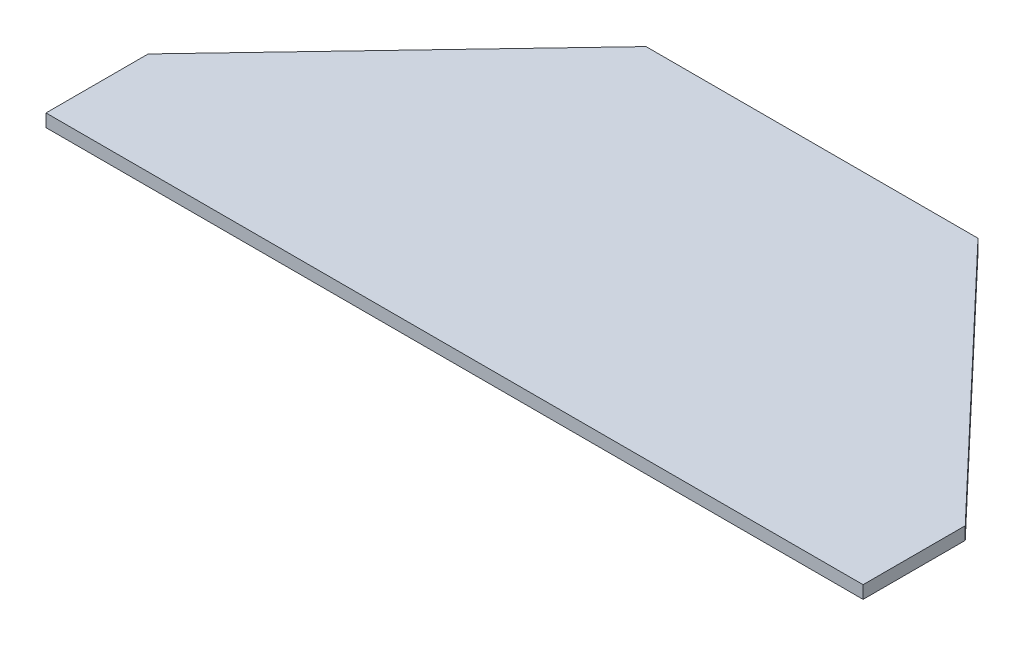
ISO-10303-21;
HEADER;
FILE_DESCRIPTION(('STEP AP214'),'2;1');
FILE_NAME('part.step','',(''),(''),'','','');
FILE_SCHEMA(('AUTOMOTIVE_DESIGN { 1 0 10303 214 1 1 1 1 }'));
ENDSEC;
DATA;
#1=APPLICATION_CONTEXT('core data for automotive mechanical design processes');
#2=APPLICATION_PROTOCOL_DEFINITION('international standard','automotive_design',2000,#1);
#3=PRODUCT_CONTEXT('',#1,'mechanical');
#4=PRODUCT('Part','Part','',(#3));
#5=PRODUCT_RELATED_PRODUCT_CATEGORY('part','',(#4));
#6=PRODUCT_DEFINITION_FORMATION('','',#4);
#7=PRODUCT_DEFINITION_CONTEXT('part definition',#1,'design');
#8=PRODUCT_DEFINITION('design','',#6,#7);
#9=PRODUCT_DEFINITION_SHAPE('','',#8);
#10=(LENGTH_UNIT() NAMED_UNIT(*) SI_UNIT(.MILLI.,.METRE.));
#11=(NAMED_UNIT(*) PLANE_ANGLE_UNIT() SI_UNIT($,.RADIAN.));
#12=(NAMED_UNIT(*) SI_UNIT($,.STERADIAN.) SOLID_ANGLE_UNIT());
#13=UNCERTAINTY_MEASURE_WITH_UNIT(LENGTH_MEASURE(1.E-05),#10,'distance_accuracy_value','');
#14=(GEOMETRIC_REPRESENTATION_CONTEXT(3) GLOBAL_UNCERTAINTY_ASSIGNED_CONTEXT((#13)) GLOBAL_UNIT_ASSIGNED_CONTEXT((#10,
#11,#12)) REPRESENTATION_CONTEXT('',''));
#15=CARTESIAN_POINT('',(0.,0.,0.));
#16=DIRECTION('',(0.,0.,1.));
#17=DIRECTION('',(1.,0.,0.));
#18=AXIS2_PLACEMENT_3D('',#15,#16,#17);
#19=CARTESIAN_POINT('',(-203.2,3.175,-50.8));
#20=DIRECTION('',(1.,0.,0.));
#21=DIRECTION('',(0.,0.,-1.));
#22=AXIS2_PLACEMENT_3D('',#19,#20,#21);
#23=PLANE('',#22);
#24=DIRECTION('',(0.,0.,1.));
#25=VECTOR('',#24,1.);
#26=CARTESIAN_POINT('',(-203.2,-3.175,-50.8));
#27=LINE('',#26,#25);
#28=CARTESIAN_POINT('',(-203.2,-3.175,-50.8));
#29=VERTEX_POINT('',#28);
#30=CARTESIAN_POINT('',(-203.2,-3.175,0.));
#31=VERTEX_POINT('',#30);
#32=EDGE_CURVE('E127',#29,#31,#27,.T.);
#33=ORIENTED_EDGE('',*,*,#32,.T.);
#34=DIRECTION('',(0.,-1.,0.));
#35=VECTOR('',#34,1.);
#36=CARTESIAN_POINT('',(-203.2,3.175,0.));
#37=LINE('',#36,#35);
#38=CARTESIAN_POINT('',(-203.2,3.175,0.));
#39=VERTEX_POINT('',#38);
#40=EDGE_CURVE('E11',#39,#31,#37,.T.);
#41=ORIENTED_EDGE('',*,*,#40,.F.);
#42=DIRECTION('',(0.,0.,1.));
#43=VECTOR('',#42,1.);
#44=CARTESIAN_POINT('',(-203.2,3.175,-50.8));
#45=LINE('',#44,#43);
#46=CARTESIAN_POINT('',(-203.2,3.175,-50.8));
#47=VERTEX_POINT('',#46);
#48=EDGE_CURVE('E137',#47,#39,#45,.T.);
#49=ORIENTED_EDGE('',*,*,#48,.F.);
#50=DIRECTION('',(0.,-1.,0.));
#51=VECTOR('',#50,1.);
#52=CARTESIAN_POINT('',(-203.2,3.175,-50.8));
#53=LINE('',#52,#51);
#54=EDGE_CURVE('E123',#47,#29,#53,.T.);
#55=ORIENTED_EDGE('',*,*,#54,.T.);
#56=EDGE_LOOP('',(#33,#41,#49,#55));
#57=FACE_BOUND('',#56,.T.);
#58=ADVANCED_FACE('F43',(#57),#23,.F.);
#59=CARTESIAN_POINT('',(-203.2,3.175,0.));
#60=DIRECTION('',(0.,0.,-1.));
#61=DIRECTION('',(-1.,0.,0.));
#62=AXIS2_PLACEMENT_3D('',#59,#60,#61);
#63=PLANE('',#62);
#64=DIRECTION('',(1.,0.,0.));
#65=VECTOR('',#64,1.);
#66=CARTESIAN_POINT('',(-203.2,-3.175,0.));
#67=LINE('',#66,#65);
#68=CARTESIAN_POINT('',(203.2,-3.175,0.));
#69=VERTEX_POINT('',#68);
#70=EDGE_CURVE('E130',#31,#69,#67,.T.);
#71=ORIENTED_EDGE('',*,*,#70,.T.);
#72=DIRECTION('',(0.,-1.,0.));
#73=VECTOR('',#72,1.);
#74=CARTESIAN_POINT('',(203.2,3.175,0.));
#75=LINE('',#74,#73);
#76=CARTESIAN_POINT('',(203.2,3.175,0.));
#77=VERTEX_POINT('',#76);
#78=EDGE_CURVE('E51',#77,#69,#75,.T.);
#79=ORIENTED_EDGE('',*,*,#78,.F.);
#80=DIRECTION('',(1.,0.,0.));
#81=VECTOR('',#80,1.);
#82=CARTESIAN_POINT('',(-203.2,3.175,0.));
#83=LINE('',#82,#81);
#84=EDGE_CURVE('E96',#39,#77,#83,.T.);
#85=ORIENTED_EDGE('',*,*,#84,.F.);
#86=ORIENTED_EDGE('',*,*,#40,.T.);
#87=EDGE_LOOP('',(#71,#79,#85,#86));
#88=FACE_BOUND('',#87,.T.);
#89=ADVANCED_FACE('F161',(#88),#63,.F.);
#90=CARTESIAN_POINT('',(203.2,3.175,0.));
#91=DIRECTION('',(-1.,0.,0.));
#92=DIRECTION('',(0.,0.,1.));
#93=AXIS2_PLACEMENT_3D('',#90,#91,#92);
#94=PLANE('',#93);
#95=DIRECTION('',(0.,0.,-1.));
#96=VECTOR('',#95,1.);
#97=CARTESIAN_POINT('',(203.2,-3.175,0.));
#98=LINE('',#97,#96);
#99=CARTESIAN_POINT('',(203.2,-3.175,-50.8000000000001));
#100=VERTEX_POINT('',#99);
#101=EDGE_CURVE('E132',#69,#100,#98,.T.);
#102=ORIENTED_EDGE('',*,*,#101,.T.);
#103=DIRECTION('',(0.,-1.,0.));
#104=VECTOR('',#103,1.);
#105=CARTESIAN_POINT('',(203.2,3.175,-50.8000000000001));
#106=LINE('',#105,#104);
#107=CARTESIAN_POINT('',(203.2,3.175,-50.8000000000001));
#108=VERTEX_POINT('',#107);
#109=EDGE_CURVE('E118',#108,#100,#106,.T.);
#110=ORIENTED_EDGE('',*,*,#109,.F.);
#111=DIRECTION('',(0.,0.,-1.));
#112=VECTOR('',#111,1.);
#113=CARTESIAN_POINT('',(203.2,3.175,0.));
#114=LINE('',#113,#112);
#115=EDGE_CURVE('E109',#77,#108,#114,.T.);
#116=ORIENTED_EDGE('',*,*,#115,.F.);
#117=ORIENTED_EDGE('',*,*,#78,.T.);
#118=EDGE_LOOP('',(#102,#110,#116,#117));
#119=FACE_BOUND('',#118,.T.);
#120=ADVANCED_FACE('F143',(#119),#94,.F.);
#121=CARTESIAN_POINT('',(203.2,3.175,-50.8000000000001));
#122=DIRECTION('',(-0.724999433594413,0.,0.688749461914693));
#123=DIRECTION('',(0.688749461914693,0.,0.724999433594413));
#124=AXIS2_PLACEMENT_3D('',#121,#122,#123);
#125=PLANE('',#124);
#126=DIRECTION('',(-0.688749461914693,0.,-0.724999433594413));
#127=VECTOR('',#126,1.);
#128=CARTESIAN_POINT('',(203.2,-3.175,-50.8000000000001));
#129=LINE('',#128,#127);
#130=CARTESIAN_POINT('',(82.55,-3.175,-177.8));
#131=VERTEX_POINT('',#130);
#132=EDGE_CURVE('E117',#100,#131,#129,.T.);
#133=ORIENTED_EDGE('',*,*,#132,.T.);
#134=DIRECTION('',(0.,-1.,0.));
#135=VECTOR('',#134,1.);
#136=CARTESIAN_POINT('',(82.55,3.175,-177.8));
#137=LINE('',#136,#135);
#138=CARTESIAN_POINT('',(82.55,3.175,-177.8));
#139=VERTEX_POINT('',#138);
#140=EDGE_CURVE('E114',#139,#131,#137,.T.);
#141=ORIENTED_EDGE('',*,*,#140,.F.);
#142=DIRECTION('',(-0.688749461914693,0.,-0.724999433594413));
#143=VECTOR('',#142,1.);
#144=CARTESIAN_POINT('',(203.2,3.175,-50.8000000000001));
#145=LINE('',#144,#143);
#146=EDGE_CURVE('E103',#108,#139,#145,.T.);
#147=ORIENTED_EDGE('',*,*,#146,.F.);
#148=ORIENTED_EDGE('',*,*,#109,.T.);
#149=EDGE_LOOP('',(#133,#141,#147,#148));
#150=FACE_BOUND('',#149,.T.);
#151=ADVANCED_FACE('F115',(#150),#125,.F.);
#152=CARTESIAN_POINT('',(82.55,3.175,-177.8));
#153=DIRECTION('',(0.,0.,1.));
#154=DIRECTION('',(1.,0.,0.));
#155=AXIS2_PLACEMENT_3D('',#152,#153,#154);
#156=PLANE('',#155);
#157=DIRECTION('',(-1.,0.,0.));
#158=VECTOR('',#157,1.);
#159=CARTESIAN_POINT('',(82.55,-3.175,-177.8));
#160=LINE('',#159,#158);
#161=CARTESIAN_POINT('',(-82.55,-3.175,-177.8));
#162=VERTEX_POINT('',#161);
#163=EDGE_CURVE('E82',#131,#162,#160,.T.);
#164=ORIENTED_EDGE('',*,*,#163,.T.);
#165=DIRECTION('',(0.,-1.,0.));
#166=VECTOR('',#165,1.);
#167=CARTESIAN_POINT('',(-82.55,3.175,-177.8));
#168=LINE('',#167,#166);
#169=CARTESIAN_POINT('',(-82.55,3.175,-177.8));
#170=VERTEX_POINT('',#169);
#171=EDGE_CURVE('E119',#170,#162,#168,.T.);
#172=ORIENTED_EDGE('',*,*,#171,.F.);
#173=DIRECTION('',(-1.,0.,0.));
#174=VECTOR('',#173,1.);
#175=CARTESIAN_POINT('',(82.55,3.175,-177.8));
#176=LINE('',#175,#174);
#177=EDGE_CURVE('E107',#139,#170,#176,.T.);
#178=ORIENTED_EDGE('',*,*,#177,.F.);
#179=ORIENTED_EDGE('',*,*,#140,.T.);
#180=EDGE_LOOP('',(#164,#172,#178,#179));
#181=FACE_BOUND('',#180,.T.);
#182=ADVANCED_FACE('F121',(#181),#156,.F.);
#183=CARTESIAN_POINT('',(-82.55,3.175,-177.8));
#184=DIRECTION('',(0.724999433594413,0.,0.688749461914693));
#185=DIRECTION('',(0.688749461914693,0.,-0.724999433594413));
#186=AXIS2_PLACEMENT_3D('',#183,#184,#185);
#187=PLANE('',#186);
#188=DIRECTION('',(-0.688749461914693,0.,0.724999433594414));
#189=VECTOR('',#188,1.);
#190=CARTESIAN_POINT('',(-82.55,-3.175,-177.8));
#191=LINE('',#190,#189);
#192=EDGE_CURVE('E88',#162,#29,#191,.T.);
#193=ORIENTED_EDGE('',*,*,#192,.T.);
#194=ORIENTED_EDGE('',*,*,#54,.F.);
#195=DIRECTION('',(-0.688749461914693,0.,0.724999433594414));
#196=VECTOR('',#195,1.);
#197=CARTESIAN_POINT('',(-82.55,3.175,-177.8));
#198=LINE('',#197,#196);
#199=EDGE_CURVE('E59',#170,#47,#198,.T.);
#200=ORIENTED_EDGE('',*,*,#199,.F.);
#201=ORIENTED_EDGE('',*,*,#171,.T.);
#202=EDGE_LOOP('',(#193,#194,#200,#201));
#203=FACE_BOUND('',#202,.T.);
#204=ADVANCED_FACE('F150',(#203),#187,.F.);
#205=CARTESIAN_POINT('',(0.,3.175,0.));
#206=DIRECTION('',(0.,1.,0.));
#207=DIRECTION('',(0.,0.,1.));
#208=AXIS2_PLACEMENT_3D('',#205,#206,#207);
#209=PLANE('',#208);
#210=ORIENTED_EDGE('',*,*,#48,.T.);
#211=ORIENTED_EDGE('',*,*,#84,.T.);
#212=ORIENTED_EDGE('',*,*,#115,.T.);
#213=ORIENTED_EDGE('',*,*,#146,.T.);
#214=ORIENTED_EDGE('',*,*,#177,.T.);
#215=ORIENTED_EDGE('',*,*,#199,.T.);
#216=EDGE_LOOP('',(#210,#211,#212,#213,#214,#215));
#217=FACE_BOUND('',#216,.T.);
#218=ADVANCED_FACE('F105',(#217),#209,.T.);
#219=CARTESIAN_POINT('',(0.,-3.175,0.));
#220=DIRECTION('',(0.,1.,0.));
#221=DIRECTION('',(0.,0.,1.));
#222=AXIS2_PLACEMENT_3D('',#219,#220,#221);
#223=PLANE('',#222);
#224=ORIENTED_EDGE('',*,*,#32,.F.);
#225=ORIENTED_EDGE('',*,*,#192,.F.);
#226=ORIENTED_EDGE('',*,*,#163,.F.);
#227=ORIENTED_EDGE('',*,*,#132,.F.);
#228=ORIENTED_EDGE('',*,*,#101,.F.);
#229=ORIENTED_EDGE('',*,*,#70,.F.);
#230=EDGE_LOOP('',(#224,#225,#226,#227,#228,#229));
#231=FACE_BOUND('',#230,.T.);
#232=ADVANCED_FACE('F146',(#231),#223,.F.);
#233=CLOSED_SHELL('',(#58,#89,#120,#151,#182,#204,#218,#232));
#234=MANIFOLD_SOLID_BREP('B2',#233);
#235=ADVANCED_BREP_SHAPE_REPRESENTATION('',(#18,#234),#14);
#236=SHAPE_DEFINITION_REPRESENTATION(#9,#235);
ENDSEC;
END-ISO-10303-21;
